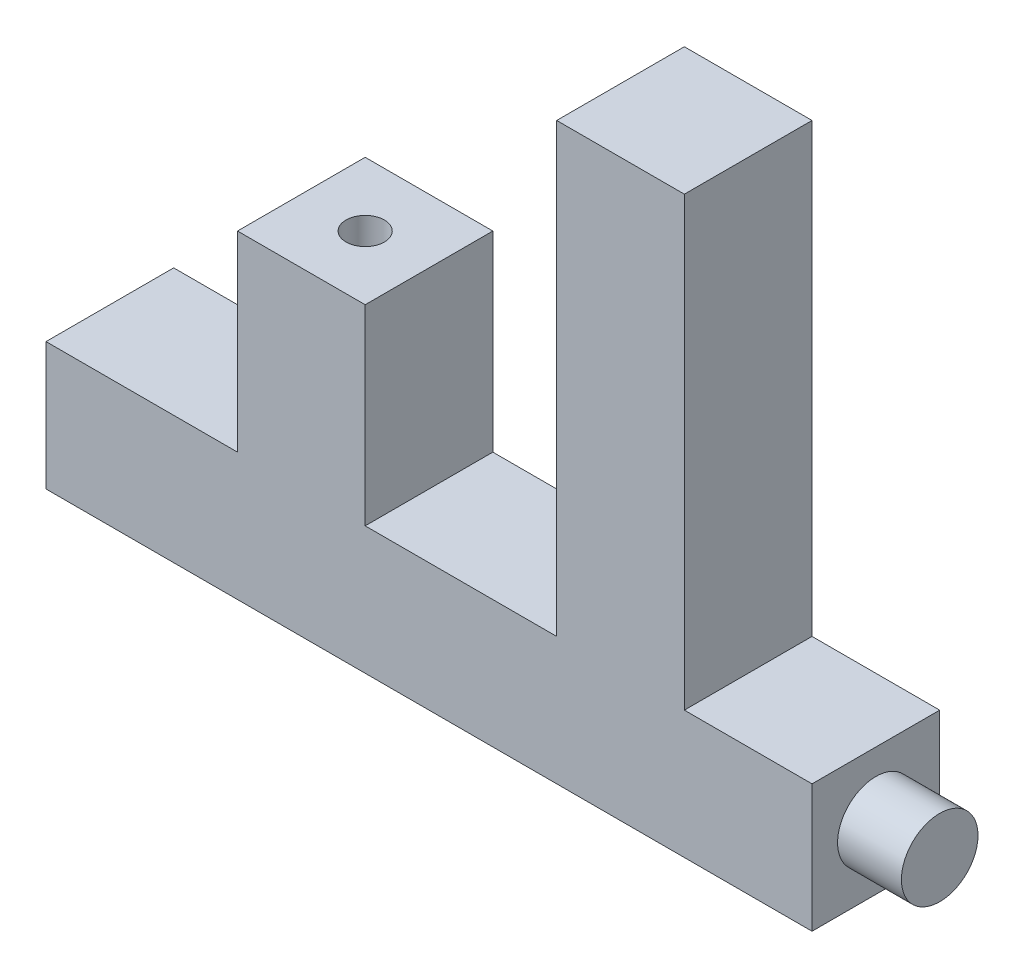
ISO-10303-21;
HEADER;
FILE_DESCRIPTION(('STEP AP214'),'2;1');
FILE_NAME('part.step','',(''),(''),'','','');
FILE_SCHEMA(('AUTOMOTIVE_DESIGN { 1 0 10303 214 1 1 1 1 }'));
ENDSEC;
DATA;
#1=APPLICATION_CONTEXT('core data for automotive mechanical design processes');
#2=APPLICATION_PROTOCOL_DEFINITION('international standard','automotive_design',2000,#1);
#3=PRODUCT_CONTEXT('',#1,'mechanical');
#4=PRODUCT('Part','Part','',(#3));
#5=PRODUCT_RELATED_PRODUCT_CATEGORY('part','',(#4));
#6=PRODUCT_DEFINITION_FORMATION('','',#4);
#7=PRODUCT_DEFINITION_CONTEXT('part definition',#1,'design');
#8=PRODUCT_DEFINITION('design','',#6,#7);
#9=PRODUCT_DEFINITION_SHAPE('','',#8);
#10=(LENGTH_UNIT() NAMED_UNIT(*) SI_UNIT(.MILLI.,.METRE.));
#11=(NAMED_UNIT(*) PLANE_ANGLE_UNIT() SI_UNIT($,.RADIAN.));
#12=(NAMED_UNIT(*) SI_UNIT($,.STERADIAN.) SOLID_ANGLE_UNIT());
#13=UNCERTAINTY_MEASURE_WITH_UNIT(LENGTH_MEASURE(1.E-05),#10,'distance_accuracy_value','');
#14=(GEOMETRIC_REPRESENTATION_CONTEXT(3) GLOBAL_UNCERTAINTY_ASSIGNED_CONTEXT((#13)) GLOBAL_UNIT_ASSIGNED_CONTEXT((#10,
#11,#12)) REPRESENTATION_CONTEXT('',''));
#15=CARTESIAN_POINT('',(0.,0.,0.));
#16=DIRECTION('',(0.,0.,1.));
#17=DIRECTION('',(1.,0.,0.));
#18=AXIS2_PLACEMENT_3D('',#15,#16,#17);
#19=CARTESIAN_POINT('',(0.,0.,20.));
#20=DIRECTION('',(0.,1.,0.));
#21=DIRECTION('',(0.,0.,1.));
#22=AXIS2_PLACEMENT_3D('',#19,#20,#21);
#23=PLANE('',#22);
#24=DIRECTION('',(0.,0.,-1.));
#25=VECTOR('',#24,1.);
#26=CARTESIAN_POINT('',(120.,0.,20.));
#27=LINE('',#26,#25);
#28=CARTESIAN_POINT('',(120.,0.,20.));
#29=VERTEX_POINT('',#28);
#30=CARTESIAN_POINT('',(120.,0.,0.));
#31=VERTEX_POINT('',#30);
#32=EDGE_CURVE('E47',#29,#31,#27,.T.);
#33=ORIENTED_EDGE('',*,*,#32,.F.);
#34=DIRECTION('',(1.,0.,0.));
#35=VECTOR('',#34,1.);
#36=CARTESIAN_POINT('',(0.,0.,20.));
#37=LINE('',#36,#35);
#38=CARTESIAN_POINT('',(0.,0.,20.));
#39=VERTEX_POINT('',#38);
#40=EDGE_CURVE('E211',#39,#29,#37,.T.);
#41=ORIENTED_EDGE('',*,*,#40,.F.);
#42=DIRECTION('',(0.,0.,-1.));
#43=VECTOR('',#42,1.);
#44=CARTESIAN_POINT('',(0.,0.,20.));
#45=LINE('',#44,#43);
#46=CARTESIAN_POINT('',(0.,0.,0.));
#47=VERTEX_POINT('',#46);
#48=EDGE_CURVE('E189',#39,#47,#45,.T.);
#49=ORIENTED_EDGE('',*,*,#48,.T.);
#50=DIRECTION('',(1.,0.,0.));
#51=VECTOR('',#50,1.);
#52=CARTESIAN_POINT('',(0.,0.,0.));
#53=LINE('',#52,#51);
#54=EDGE_CURVE('E161',#47,#31,#53,.T.);
#55=ORIENTED_EDGE('',*,*,#54,.T.);
#56=EDGE_LOOP('',(#33,#41,#49,#55));
#57=FACE_BOUND('',#56,.T.);
#58=ADVANCED_FACE('F32',(#57),#23,.F.);
#59=CARTESIAN_POINT('',(100.,20.,20.));
#60=DIRECTION('',(0.,-1.,0.));
#61=DIRECTION('',(0.,0.,-1.));
#62=AXIS2_PLACEMENT_3D('',#59,#60,#61);
#63=PLANE('',#62);
#64=DIRECTION('',(0.,0.,1.));
#65=VECTOR('',#64,1.);
#66=CARTESIAN_POINT('',(120.,20.,20.));
#67=LINE('',#66,#65);
#68=CARTESIAN_POINT('',(120.,20.,0.));
#69=VERTEX_POINT('',#68);
#70=CARTESIAN_POINT('',(120.,20.,20.));
#71=VERTEX_POINT('',#70);
#72=EDGE_CURVE('E243',#69,#71,#67,.T.);
#73=ORIENTED_EDGE('',*,*,#72,.F.);
#74=DIRECTION('',(-1.,0.,0.));
#75=VECTOR('',#74,1.);
#76=CARTESIAN_POINT('',(100.,20.,0.));
#77=LINE('',#76,#75);
#78=CARTESIAN_POINT('',(100.,20.,0.));
#79=VERTEX_POINT('',#78);
#80=EDGE_CURVE('E164',#69,#79,#77,.T.);
#81=ORIENTED_EDGE('',*,*,#80,.T.);
#82=DIRECTION('',(0.,0.,-1.));
#83=VECTOR('',#82,1.);
#84=CARTESIAN_POINT('',(100.,20.,20.));
#85=LINE('',#84,#83);
#86=CARTESIAN_POINT('',(100.,20.,20.));
#87=VERTEX_POINT('',#86);
#88=EDGE_CURVE('E186',#87,#79,#85,.T.);
#89=ORIENTED_EDGE('',*,*,#88,.F.);
#90=DIRECTION('',(-1.,0.,0.));
#91=VECTOR('',#90,1.);
#92=CARTESIAN_POINT('',(100.,20.,20.));
#93=LINE('',#92,#91);
#94=EDGE_CURVE('E212',#71,#87,#93,.T.);
#95=ORIENTED_EDGE('',*,*,#94,.F.);
#96=EDGE_LOOP('',(#73,#81,#89,#95));
#97=FACE_BOUND('',#96,.T.);
#98=ADVANCED_FACE('F266',(#97),#63,.F.);
#99=CARTESIAN_POINT('',(30.,50.,20.));
#100=DIRECTION('',(0.,0.,-1.));
#101=DIRECTION('',(-1.,0.,0.));
#102=AXIS2_PLACEMENT_3D('',#99,#100,#101);
#103=PLANE('',#102);
#104=DIRECTION('',(0.,-1.,0.));
#105=VECTOR('',#104,1.);
#106=CARTESIAN_POINT('',(120.,50.,20.));
#107=LINE('',#106,#105);
#108=EDGE_CURVE('E238',#71,#29,#107,.T.);
#109=ORIENTED_EDGE('',*,*,#108,.F.);
#110=ORIENTED_EDGE('',*,*,#94,.T.);
#111=DIRECTION('',(0.,1.,0.));
#112=VECTOR('',#111,1.);
#113=CARTESIAN_POINT('',(100.,90.,20.));
#114=LINE('',#113,#112);
#115=CARTESIAN_POINT('',(100.,90.,20.));
#116=VERTEX_POINT('',#115);
#117=EDGE_CURVE('E215',#87,#116,#114,.T.);
#118=ORIENTED_EDGE('',*,*,#117,.T.);
#119=DIRECTION('',(-1.,0.,0.));
#120=VECTOR('',#119,1.);
#121=CARTESIAN_POINT('',(80.,90.,20.));
#122=LINE('',#121,#120);
#123=CARTESIAN_POINT('',(80.,90.,20.));
#124=VERTEX_POINT('',#123);
#125=EDGE_CURVE('E221',#116,#124,#122,.T.);
#126=ORIENTED_EDGE('',*,*,#125,.T.);
#127=DIRECTION('',(0.,-1.,0.));
#128=VECTOR('',#127,1.);
#129=CARTESIAN_POINT('',(80.,20.,20.));
#130=LINE('',#129,#128);
#131=CARTESIAN_POINT('',(80.,20.,20.));
#132=VERTEX_POINT('',#131);
#133=EDGE_CURVE('E132',#124,#132,#130,.T.);
#134=ORIENTED_EDGE('',*,*,#133,.T.);
#135=DIRECTION('',(-1.,0.,0.));
#136=VECTOR('',#135,1.);
#137=CARTESIAN_POINT('',(50.,20.,20.));
#138=LINE('',#137,#136);
#139=CARTESIAN_POINT('',(50.,20.,20.));
#140=VERTEX_POINT('',#139);
#141=EDGE_CURVE('E124',#132,#140,#138,.T.);
#142=ORIENTED_EDGE('',*,*,#141,.T.);
#143=DIRECTION('',(0.,1.,0.));
#144=VECTOR('',#143,1.);
#145=CARTESIAN_POINT('',(50.,50.,20.));
#146=LINE('',#145,#144);
#147=CARTESIAN_POINT('',(50.,50.,20.));
#148=VERTEX_POINT('',#147);
#149=EDGE_CURVE('E129',#140,#148,#146,.T.);
#150=ORIENTED_EDGE('',*,*,#149,.T.);
#151=DIRECTION('',(-1.,0.,0.));
#152=VECTOR('',#151,1.);
#153=CARTESIAN_POINT('',(30.,50.,20.));
#154=LINE('',#153,#152);
#155=CARTESIAN_POINT('',(30.,50.,20.));
#156=VERTEX_POINT('',#155);
#157=EDGE_CURVE('E55',#148,#156,#154,.T.);
#158=ORIENTED_EDGE('',*,*,#157,.T.);
#159=DIRECTION('',(0.,-1.,0.));
#160=VECTOR('',#159,1.);
#161=CARTESIAN_POINT('',(30.,20.,20.));
#162=LINE('',#161,#160);
#163=CARTESIAN_POINT('',(30.,20.,20.));
#164=VERTEX_POINT('',#163);
#165=EDGE_CURVE('E176',#156,#164,#162,.T.);
#166=ORIENTED_EDGE('',*,*,#165,.T.);
#167=DIRECTION('',(-1.,0.,0.));
#168=VECTOR('',#167,1.);
#169=CARTESIAN_POINT('',(0.,20.,20.));
#170=LINE('',#169,#168);
#171=CARTESIAN_POINT('',(0.,20.,20.));
#172=VERTEX_POINT('',#171);
#173=EDGE_CURVE('E103',#164,#172,#170,.T.);
#174=ORIENTED_EDGE('',*,*,#173,.T.);
#175=DIRECTION('',(0.,-1.,0.));
#176=VECTOR('',#175,1.);
#177=CARTESIAN_POINT('',(0.,0.,20.));
#178=LINE('',#177,#176);
#179=EDGE_CURVE('E213',#172,#39,#178,.T.);
#180=ORIENTED_EDGE('',*,*,#179,.T.);
#181=ORIENTED_EDGE('',*,*,#40,.T.);
#182=EDGE_LOOP('',(#109,#110,#118,#126,#134,#142,#150,#158,#166,#174,#180,#181));
#183=FACE_BOUND('',#182,.T.);
#184=ADVANCED_FACE('F127',(#183),#103,.F.);
#185=CARTESIAN_POINT('',(30.,50.,0.));
#186=DIRECTION('',(0.,0.,-1.));
#187=DIRECTION('',(-1.,0.,0.));
#188=AXIS2_PLACEMENT_3D('',#185,#186,#187);
#189=PLANE('',#188);
#190=ORIENTED_EDGE('',*,*,#80,.F.);
#191=DIRECTION('',(0.,-1.,0.));
#192=VECTOR('',#191,1.);
#193=CARTESIAN_POINT('',(120.,50.,0.));
#194=LINE('',#193,#192);
#195=EDGE_CURVE('E12',#69,#31,#194,.T.);
#196=ORIENTED_EDGE('',*,*,#195,.T.);
#197=ORIENTED_EDGE('',*,*,#54,.F.);
#198=DIRECTION('',(0.,-1.,0.));
#199=VECTOR('',#198,1.);
#200=CARTESIAN_POINT('',(0.,0.,0.));
#201=LINE('',#200,#199);
#202=CARTESIAN_POINT('',(0.,20.,0.));
#203=VERTEX_POINT('',#202);
#204=EDGE_CURVE('E159',#203,#47,#201,.T.);
#205=ORIENTED_EDGE('',*,*,#204,.F.);
#206=DIRECTION('',(-1.,0.,0.));
#207=VECTOR('',#206,1.);
#208=CARTESIAN_POINT('',(0.,20.,0.));
#209=LINE('',#208,#207);
#210=CARTESIAN_POINT('',(30.,20.,0.));
#211=VERTEX_POINT('',#210);
#212=EDGE_CURVE('E156',#211,#203,#209,.T.);
#213=ORIENTED_EDGE('',*,*,#212,.F.);
#214=DIRECTION('',(0.,-1.,0.));
#215=VECTOR('',#214,1.);
#216=CARTESIAN_POINT('',(30.,20.,0.));
#217=LINE('',#216,#215);
#218=CARTESIAN_POINT('',(30.,50.,0.));
#219=VERTEX_POINT('',#218);
#220=EDGE_CURVE('E153',#219,#211,#217,.T.);
#221=ORIENTED_EDGE('',*,*,#220,.F.);
#222=DIRECTION('',(-1.,0.,0.));
#223=VECTOR('',#222,1.);
#224=CARTESIAN_POINT('',(30.,50.,0.));
#225=LINE('',#224,#223);
#226=CARTESIAN_POINT('',(50.,50.,0.));
#227=VERTEX_POINT('',#226);
#228=EDGE_CURVE('E94',#227,#219,#225,.T.);
#229=ORIENTED_EDGE('',*,*,#228,.F.);
#230=DIRECTION('',(0.,1.,0.));
#231=VECTOR('',#230,1.);
#232=CARTESIAN_POINT('',(50.,50.,0.));
#233=LINE('',#232,#231);
#234=CARTESIAN_POINT('',(50.,20.,0.));
#235=VERTEX_POINT('',#234);
#236=EDGE_CURVE('E173',#235,#227,#233,.T.);
#237=ORIENTED_EDGE('',*,*,#236,.F.);
#238=DIRECTION('',(-1.,0.,0.));
#239=VECTOR('',#238,1.);
#240=CARTESIAN_POINT('',(50.,20.,0.));
#241=LINE('',#240,#239);
#242=CARTESIAN_POINT('',(80.,20.,0.));
#243=VERTEX_POINT('',#242);
#244=EDGE_CURVE('E141',#243,#235,#241,.T.);
#245=ORIENTED_EDGE('',*,*,#244,.F.);
#246=DIRECTION('',(0.,-1.,0.));
#247=VECTOR('',#246,1.);
#248=CARTESIAN_POINT('',(80.,20.,0.));
#249=LINE('',#248,#247);
#250=CARTESIAN_POINT('',(80.,90.,0.));
#251=VERTEX_POINT('',#250);
#252=EDGE_CURVE('E170',#251,#243,#249,.T.);
#253=ORIENTED_EDGE('',*,*,#252,.F.);
#254=DIRECTION('',(-1.,0.,0.));
#255=VECTOR('',#254,1.);
#256=CARTESIAN_POINT('',(80.,90.,0.));
#257=LINE('',#256,#255);
#258=CARTESIAN_POINT('',(100.,90.,0.));
#259=VERTEX_POINT('',#258);
#260=EDGE_CURVE('E168',#259,#251,#257,.T.);
#261=ORIENTED_EDGE('',*,*,#260,.F.);
#262=DIRECTION('',(0.,1.,0.));
#263=VECTOR('',#262,1.);
#264=CARTESIAN_POINT('',(100.,90.,0.));
#265=LINE('',#264,#263);
#266=EDGE_CURVE('E166',#79,#259,#265,.T.);
#267=ORIENTED_EDGE('',*,*,#266,.F.);
#268=EDGE_LOOP('',(#190,#196,#197,#205,#213,#221,#229,#237,#245,#253,#261,#267));
#269=FACE_BOUND('',#268,.T.);
#270=ADVANCED_FACE('F201',(#269),#189,.T.);
#271=CARTESIAN_POINT('',(30.,20.,20.));
#272=DIRECTION('',(1.,0.,0.));
#273=DIRECTION('',(0.,1.,0.));
#274=AXIS2_PLACEMENT_3D('',#271,#272,#273);
#275=PLANE('',#274);
#276=ORIENTED_EDGE('',*,*,#220,.T.);
#277=DIRECTION('',(0.,0.,-1.));
#278=VECTOR('',#277,1.);
#279=CARTESIAN_POINT('',(30.,20.,20.));
#280=LINE('',#279,#278);
#281=EDGE_CURVE('E40',#164,#211,#280,.T.);
#282=ORIENTED_EDGE('',*,*,#281,.F.);
#283=ORIENTED_EDGE('',*,*,#165,.F.);
#284=DIRECTION('',(0.,0.,-1.));
#285=VECTOR('',#284,1.);
#286=CARTESIAN_POINT('',(30.,50.,20.));
#287=LINE('',#286,#285);
#288=EDGE_CURVE('E149',#156,#219,#287,.T.);
#289=ORIENTED_EDGE('',*,*,#288,.T.);
#290=EDGE_LOOP('',(#276,#282,#283,#289));
#291=FACE_BOUND('',#290,.T.);
#292=ADVANCED_FACE('F34',(#291),#275,.F.);
#293=CARTESIAN_POINT('',(0.,20.,20.));
#294=DIRECTION('',(0.,-1.,0.));
#295=DIRECTION('',(0.,0.,-1.));
#296=AXIS2_PLACEMENT_3D('',#293,#294,#295);
#297=PLANE('',#296);
#298=ORIENTED_EDGE('',*,*,#212,.T.);
#299=DIRECTION('',(0.,0.,-1.));
#300=VECTOR('',#299,1.);
#301=CARTESIAN_POINT('',(0.,20.,20.));
#302=LINE('',#301,#300);
#303=EDGE_CURVE('E192',#172,#203,#302,.T.);
#304=ORIENTED_EDGE('',*,*,#303,.F.);
#305=ORIENTED_EDGE('',*,*,#173,.F.);
#306=ORIENTED_EDGE('',*,*,#281,.T.);
#307=EDGE_LOOP('',(#298,#304,#305,#306));
#308=FACE_BOUND('',#307,.T.);
#309=ADVANCED_FACE('F195',(#308),#297,.F.);
#310=CARTESIAN_POINT('',(0.,0.,20.));
#311=DIRECTION('',(1.,0.,0.));
#312=DIRECTION('',(0.,0.,-1.));
#313=AXIS2_PLACEMENT_3D('',#310,#311,#312);
#314=PLANE('',#313);
#315=ORIENTED_EDGE('',*,*,#204,.T.);
#316=ORIENTED_EDGE('',*,*,#48,.F.);
#317=ORIENTED_EDGE('',*,*,#179,.F.);
#318=ORIENTED_EDGE('',*,*,#303,.T.);
#319=EDGE_LOOP('',(#315,#316,#317,#318));
#320=FACE_BOUND('',#319,.T.);
#321=ADVANCED_FACE('F206',(#320),#314,.F.);
#322=CARTESIAN_POINT('',(100.,90.,20.));
#323=DIRECTION('',(-1.,0.,0.));
#324=DIRECTION('',(0.,-1.,0.));
#325=AXIS2_PLACEMENT_3D('',#322,#323,#324);
#326=PLANE('',#325);
#327=ORIENTED_EDGE('',*,*,#266,.T.);
#328=DIRECTION('',(0.,0.,-1.));
#329=VECTOR('',#328,1.);
#330=CARTESIAN_POINT('',(100.,90.,20.));
#331=LINE('',#330,#329);
#332=EDGE_CURVE('E183',#116,#259,#331,.T.);
#333=ORIENTED_EDGE('',*,*,#332,.F.);
#334=ORIENTED_EDGE('',*,*,#117,.F.);
#335=ORIENTED_EDGE('',*,*,#88,.T.);
#336=EDGE_LOOP('',(#327,#333,#334,#335));
#337=FACE_BOUND('',#336,.T.);
#338=ADVANCED_FACE('F269',(#337),#326,.F.);
#339=CARTESIAN_POINT('',(80.,90.,20.));
#340=DIRECTION('',(0.,-1.,0.));
#341=DIRECTION('',(0.,0.,-1.));
#342=AXIS2_PLACEMENT_3D('',#339,#340,#341);
#343=PLANE('',#342);
#344=ORIENTED_EDGE('',*,*,#260,.T.);
#345=DIRECTION('',(0.,0.,-1.));
#346=VECTOR('',#345,1.);
#347=CARTESIAN_POINT('',(80.,90.,20.));
#348=LINE('',#347,#346);
#349=EDGE_CURVE('E180',#124,#251,#348,.T.);
#350=ORIENTED_EDGE('',*,*,#349,.F.);
#351=ORIENTED_EDGE('',*,*,#125,.F.);
#352=ORIENTED_EDGE('',*,*,#332,.T.);
#353=EDGE_LOOP('',(#344,#350,#351,#352));
#354=FACE_BOUND('',#353,.T.);
#355=ADVANCED_FACE('F227',(#354),#343,.F.);
#356=CARTESIAN_POINT('',(80.,20.,20.));
#357=DIRECTION('',(1.,0.,0.));
#358=DIRECTION('',(0.,0.,-1.));
#359=AXIS2_PLACEMENT_3D('',#356,#357,#358);
#360=PLANE('',#359);
#361=ORIENTED_EDGE('',*,*,#252,.T.);
#362=DIRECTION('',(0.,0.,-1.));
#363=VECTOR('',#362,1.);
#364=CARTESIAN_POINT('',(80.,20.,20.));
#365=LINE('',#364,#363);
#366=EDGE_CURVE('E144',#132,#243,#365,.T.);
#367=ORIENTED_EDGE('',*,*,#366,.F.);
#368=ORIENTED_EDGE('',*,*,#133,.F.);
#369=ORIENTED_EDGE('',*,*,#349,.T.);
#370=EDGE_LOOP('',(#361,#367,#368,#369));
#371=FACE_BOUND('',#370,.T.);
#372=ADVANCED_FACE('F231',(#371),#360,.F.);
#373=CARTESIAN_POINT('',(50.,20.,20.));
#374=DIRECTION('',(0.,-1.,0.));
#375=DIRECTION('',(1.,0.,0.));
#376=AXIS2_PLACEMENT_3D('',#373,#374,#375);
#377=PLANE('',#376);
#378=ORIENTED_EDGE('',*,*,#244,.T.);
#379=DIRECTION('',(0.,0.,-1.));
#380=VECTOR('',#379,1.);
#381=CARTESIAN_POINT('',(50.,20.,20.));
#382=LINE('',#381,#380);
#383=EDGE_CURVE('E138',#140,#235,#382,.T.);
#384=ORIENTED_EDGE('',*,*,#383,.F.);
#385=ORIENTED_EDGE('',*,*,#141,.F.);
#386=ORIENTED_EDGE('',*,*,#366,.T.);
#387=EDGE_LOOP('',(#378,#384,#385,#386));
#388=FACE_BOUND('',#387,.T.);
#389=ADVANCED_FACE('F139',(#388),#377,.F.);
#390=CARTESIAN_POINT('',(50.,50.,20.));
#391=DIRECTION('',(-1.,0.,0.));
#392=DIRECTION('',(0.,0.,1.));
#393=AXIS2_PLACEMENT_3D('',#390,#391,#392);
#394=PLANE('',#393);
#395=ORIENTED_EDGE('',*,*,#236,.T.);
#396=DIRECTION('',(0.,0.,-1.));
#397=VECTOR('',#396,1.);
#398=CARTESIAN_POINT('',(50.,50.,20.));
#399=LINE('',#398,#397);
#400=EDGE_CURVE('E145',#148,#227,#399,.T.);
#401=ORIENTED_EDGE('',*,*,#400,.F.);
#402=ORIENTED_EDGE('',*,*,#149,.F.);
#403=ORIENTED_EDGE('',*,*,#383,.T.);
#404=EDGE_LOOP('',(#395,#401,#402,#403));
#405=FACE_BOUND('',#404,.T.);
#406=ADVANCED_FACE('F147',(#405),#394,.F.);
#407=CARTESIAN_POINT('',(30.,50.,20.));
#408=DIRECTION('',(0.,-1.,0.));
#409=DIRECTION('',(0.,0.,-1.));
#410=AXIS2_PLACEMENT_3D('',#407,#408,#409);
#411=PLANE('',#410);
#412=CARTESIAN_POINT('',(40.,50.,10.));
#413=DIRECTION('',(0.,1.,0.));
#414=DIRECTION('',(0.,0.,1.));
#415=AXIS2_PLACEMENT_3D('',#412,#413,#414);
#416=CIRCLE('',#415,3.);
#417=CARTESIAN_POINT('',(40.,50.,13.));
#418=VERTEX_POINT('',#417);
#419=EDGE_CURVE('E235',#418,#418,#416,.T.);
#420=ORIENTED_EDGE('',*,*,#419,.F.);
#421=EDGE_LOOP('',(#420));
#422=FACE_BOUND('',#421,.T.);
#423=ORIENTED_EDGE('',*,*,#228,.T.);
#424=ORIENTED_EDGE('',*,*,#288,.F.);
#425=ORIENTED_EDGE('',*,*,#157,.F.);
#426=ORIENTED_EDGE('',*,*,#400,.T.);
#427=EDGE_LOOP('',(#423,#424,#425,#426));
#428=FACE_BOUND('',#427,.T.);
#429=ADVANCED_FACE('F232',(#422,#428),#411,.F.);
#430=CARTESIAN_POINT('',(40.,40.,10.));
#431=DIRECTION('',(0.,1.,0.));
#432=DIRECTION('',(0.,0.,1.));
#433=AXIS2_PLACEMENT_3D('',#430,#431,#432);
#434=CYLINDRICAL_SURFACE('',#433,3.);
#435=CARTESIAN_POINT('',(40.,40.,10.));
#436=DIRECTION('',(0.,1.,0.));
#437=DIRECTION('',(0.,0.,1.));
#438=AXIS2_PLACEMENT_3D('',#435,#436,#437);
#439=CIRCLE('',#438,3.);
#440=CARTESIAN_POINT('',(40.,40.,13.));
#441=VERTEX_POINT('',#440);
#442=EDGE_CURVE('E157',#441,#441,#439,.T.);
#443=ORIENTED_EDGE('',*,*,#442,.F.);
#444=EDGE_LOOP('',(#443));
#445=FACE_BOUND('',#444,.T.);
#446=ORIENTED_EDGE('',*,*,#419,.T.);
#447=EDGE_LOOP('',(#446));
#448=FACE_BOUND('',#447,.T.);
#449=ADVANCED_FACE('F303',(#445,#448),#434,.F.);
#450=CARTESIAN_POINT('',(40.,40.,10.));
#451=DIRECTION('',(0.,1.,0.));
#452=DIRECTION('',(0.,0.,1.));
#453=AXIS2_PLACEMENT_3D('',#450,#451,#452);
#454=PLANE('',#453);
#455=ORIENTED_EDGE('',*,*,#442,.T.);
#456=EDGE_LOOP('',(#455));
#457=FACE_BOUND('',#456,.T.);
#458=ADVANCED_FACE('F258',(#457),#454,.T.);
#459=CARTESIAN_POINT('',(120.,45.,10.));
#460=DIRECTION('',(1.,0.,0.));
#461=DIRECTION('',(0.,0.,-1.));
#462=AXIS2_PLACEMENT_3D('',#459,#460,#461);
#463=PLANE('',#462);
#464=CARTESIAN_POINT('',(120.,10.,10.));
#465=DIRECTION('',(1.,0.,0.));
#466=DIRECTION('',(0.,0.,-1.));
#467=AXIS2_PLACEMENT_3D('',#464,#465,#466);
#468=CIRCLE('',#467,6.);
#469=CARTESIAN_POINT('',(120.,10.,4.));
#470=VERTEX_POINT('',#469);
#471=EDGE_CURVE('E246',#470,#470,#468,.T.);
#472=ORIENTED_EDGE('',*,*,#471,.F.);
#473=EDGE_LOOP('',(#472));
#474=FACE_BOUND('',#473,.T.);
#475=ORIENTED_EDGE('',*,*,#108,.T.);
#476=ORIENTED_EDGE('',*,*,#32,.T.);
#477=ORIENTED_EDGE('',*,*,#195,.F.);
#478=ORIENTED_EDGE('',*,*,#72,.T.);
#479=EDGE_LOOP('',(#475,#476,#477,#478));
#480=FACE_BOUND('',#479,.T.);
#481=ADVANCED_FACE('F256',(#474,#480),#463,.T.);
#482=CARTESIAN_POINT('',(120.,10.,10.));
#483=DIRECTION('',(1.,0.,0.));
#484=DIRECTION('',(0.,0.,-1.));
#485=AXIS2_PLACEMENT_3D('',#482,#483,#484);
#486=CYLINDRICAL_SURFACE('',#485,6.);
#487=ORIENTED_EDGE('',*,*,#471,.T.);
#488=EDGE_LOOP('',(#487));
#489=FACE_BOUND('',#488,.T.);
#490=CARTESIAN_POINT('',(130.,10.,10.));
#491=DIRECTION('',(1.,0.,0.));
#492=DIRECTION('',(0.,0.,-1.));
#493=AXIS2_PLACEMENT_3D('',#490,#491,#492);
#494=CIRCLE('',#493,6.);
#495=CARTESIAN_POINT('',(130.,10.,4.));
#496=VERTEX_POINT('',#495);
#497=EDGE_CURVE('E247',#496,#496,#494,.T.);
#498=ORIENTED_EDGE('',*,*,#497,.F.);
#499=EDGE_LOOP('',(#498));
#500=FACE_BOUND('',#499,.T.);
#501=ADVANCED_FACE('F253',(#489,#500),#486,.T.);
#502=CARTESIAN_POINT('',(130.,20.,20.));
#503=DIRECTION('',(-1.,0.,0.));
#504=DIRECTION('',(0.,0.,1.));
#505=AXIS2_PLACEMENT_3D('',#502,#503,#504);
#506=PLANE('',#505);
#507=ORIENTED_EDGE('',*,*,#497,.T.);
#508=EDGE_LOOP('',(#507));
#509=FACE_BOUND('',#508,.T.);
#510=ADVANCED_FACE('F286',(#509),#506,.F.);
#511=CLOSED_SHELL('',(#58,#98,#184,#270,#292,#309,#321,#338,#355,#372,#389,#406,#429,#449,#458,
#481,#501,#510));
#512=MANIFOLD_SOLID_BREP('B2',#511);
#513=ADVANCED_BREP_SHAPE_REPRESENTATION('',(#18,#512),#14);
#514=SHAPE_DEFINITION_REPRESENTATION(#9,#513);
ENDSEC;
END-ISO-10303-21;
